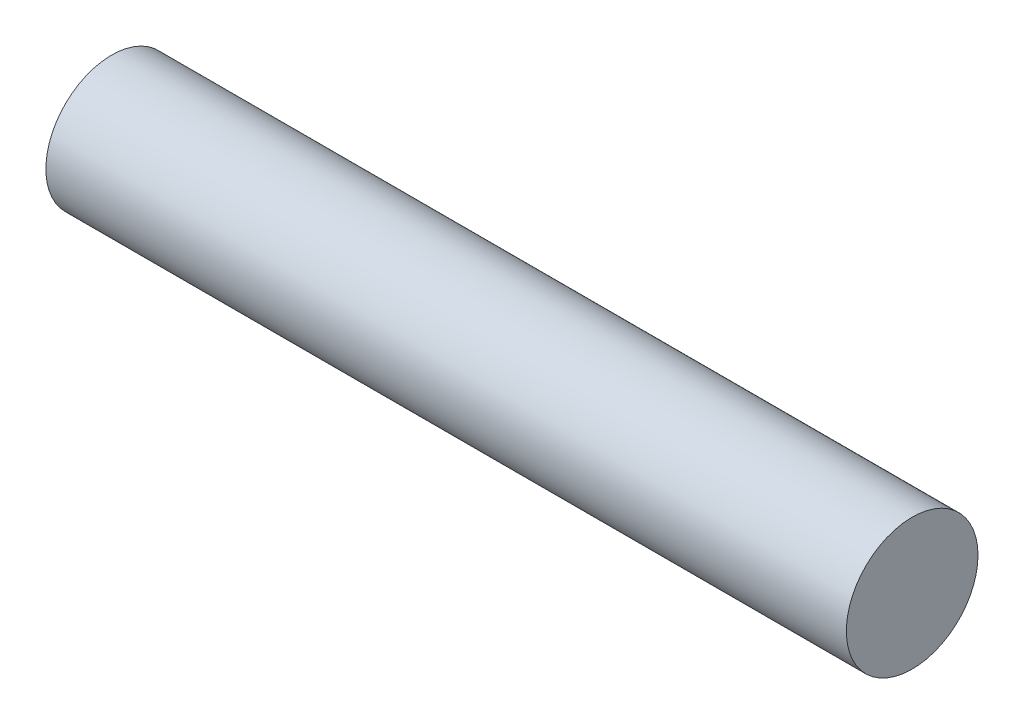
ISO-10303-21;
HEADER;
FILE_DESCRIPTION(('STEP AP214'),'2;1');
FILE_NAME('part.step','',(''),(''),'','','');
FILE_SCHEMA(('AUTOMOTIVE_DESIGN { 1 0 10303 214 1 1 1 1 }'));
ENDSEC;
DATA;
#1=APPLICATION_CONTEXT('core data for automotive mechanical design processes');
#2=APPLICATION_PROTOCOL_DEFINITION('international standard','automotive_design',2000,#1);
#3=PRODUCT_CONTEXT('',#1,'mechanical');
#4=PRODUCT('Part','Part','',(#3));
#5=PRODUCT_RELATED_PRODUCT_CATEGORY('part','',(#4));
#6=PRODUCT_DEFINITION_FORMATION('','',#4);
#7=PRODUCT_DEFINITION_CONTEXT('part definition',#1,'design');
#8=PRODUCT_DEFINITION('design','',#6,#7);
#9=PRODUCT_DEFINITION_SHAPE('','',#8);
#10=(LENGTH_UNIT() NAMED_UNIT(*) SI_UNIT(.MILLI.,.METRE.));
#11=(NAMED_UNIT(*) PLANE_ANGLE_UNIT() SI_UNIT($,.RADIAN.));
#12=(NAMED_UNIT(*) SI_UNIT($,.STERADIAN.) SOLID_ANGLE_UNIT());
#13=UNCERTAINTY_MEASURE_WITH_UNIT(LENGTH_MEASURE(1.E-05),#10,'distance_accuracy_value','');
#14=(GEOMETRIC_REPRESENTATION_CONTEXT(3) GLOBAL_UNCERTAINTY_ASSIGNED_CONTEXT((#13)) GLOBAL_UNIT_ASSIGNED_CONTEXT((#10,
#11,#12)) REPRESENTATION_CONTEXT('',''));
#15=CARTESIAN_POINT('',(0.,0.,0.));
#16=DIRECTION('',(0.,0.,1.));
#17=DIRECTION('',(1.,0.,0.));
#18=AXIS2_PLACEMENT_3D('',#15,#16,#17);
#19=CARTESIAN_POINT('',(30.4,0.,0.));
#20=DIRECTION('',(-1.,0.,0.));
#21=DIRECTION('',(0.,0.,1.));
#22=AXIS2_PLACEMENT_3D('',#19,#20,#21);
#23=CYLINDRICAL_SURFACE('',#22,2.5);
#24=CARTESIAN_POINT('',(30.4,0.,0.));
#25=DIRECTION('',(1.,0.,0.));
#26=DIRECTION('',(0.,0.,-1.));
#27=AXIS2_PLACEMENT_3D('',#24,#25,#26);
#28=CIRCLE('',#27,2.5);
#29=CARTESIAN_POINT('',(30.4,0.,-2.5));
#30=VERTEX_POINT('',#29);
#31=EDGE_CURVE('E10',#30,#30,#28,.T.);
#32=ORIENTED_EDGE('',*,*,#31,.F.);
#33=EDGE_LOOP('',(#32));
#34=FACE_BOUND('',#33,.T.);
#35=CARTESIAN_POINT('',(0.,0.,0.));
#36=DIRECTION('',(1.,0.,0.));
#37=DIRECTION('',(0.,0.,-1.));
#38=AXIS2_PLACEMENT_3D('',#35,#36,#37);
#39=CIRCLE('',#38,2.5);
#40=CARTESIAN_POINT('',(0.,0.,-2.5));
#41=VERTEX_POINT('',#40);
#42=EDGE_CURVE('E46',#41,#41,#39,.T.);
#43=ORIENTED_EDGE('',*,*,#42,.T.);
#44=EDGE_LOOP('',(#43));
#45=FACE_BOUND('',#44,.T.);
#46=ADVANCED_FACE('F43',(#34,#45),#23,.T.);
#47=CARTESIAN_POINT('',(30.4,0.,0.));
#48=DIRECTION('',(1.,0.,0.));
#49=DIRECTION('',(0.,0.,-1.));
#50=AXIS2_PLACEMENT_3D('',#47,#48,#49);
#51=PLANE('',#50);
#52=ORIENTED_EDGE('',*,*,#31,.T.);
#53=EDGE_LOOP('',(#52));
#54=FACE_BOUND('',#53,.T.);
#55=ADVANCED_FACE('F60',(#54),#51,.T.);
#56=CARTESIAN_POINT('',(0.,0.,0.));
#57=DIRECTION('',(1.,0.,0.));
#58=DIRECTION('',(0.,0.,-1.));
#59=AXIS2_PLACEMENT_3D('',#56,#57,#58);
#60=PLANE('',#59);
#61=ORIENTED_EDGE('',*,*,#42,.F.);
#62=EDGE_LOOP('',(#61));
#63=FACE_BOUND('',#62,.T.);
#64=ADVANCED_FACE('F58',(#63),#60,.F.);
#65=CLOSED_SHELL('',(#46,#55,#64));
#66=MANIFOLD_SOLID_BREP('B2',#65);
#67=ADVANCED_BREP_SHAPE_REPRESENTATION('',(#18,#66),#14);
#68=SHAPE_DEFINITION_REPRESENTATION(#9,#67);
ENDSEC;
END-ISO-10303-21;
